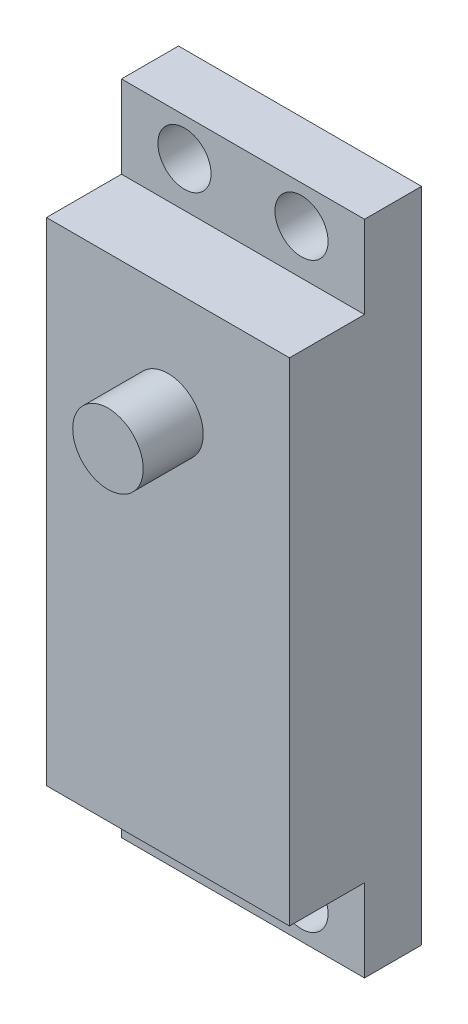
ISO-10303-21;
HEADER;
FILE_DESCRIPTION(('STEP AP214'),'2;1');
FILE_NAME('part.step','',(''),(''),'','','');
FILE_SCHEMA(('AUTOMOTIVE_DESIGN { 1 0 10303 214 1 1 1 1 }'));
ENDSEC;
DATA;
#1=APPLICATION_CONTEXT('core data for automotive mechanical design processes');
#2=APPLICATION_PROTOCOL_DEFINITION('international standard','automotive_design',2000,#1);
#3=PRODUCT_CONTEXT('',#1,'mechanical');
#4=PRODUCT('Part','Part','',(#3));
#5=PRODUCT_RELATED_PRODUCT_CATEGORY('part','',(#4));
#6=PRODUCT_DEFINITION_FORMATION('','',#4);
#7=PRODUCT_DEFINITION_CONTEXT('part definition',#1,'design');
#8=PRODUCT_DEFINITION('design','',#6,#7);
#9=PRODUCT_DEFINITION_SHAPE('','',#8);
#10=(LENGTH_UNIT() NAMED_UNIT(*) SI_UNIT(.MILLI.,.METRE.));
#11=(NAMED_UNIT(*) PLANE_ANGLE_UNIT() SI_UNIT($,.RADIAN.));
#12=(NAMED_UNIT(*) SI_UNIT($,.STERADIAN.) SOLID_ANGLE_UNIT());
#13=UNCERTAINTY_MEASURE_WITH_UNIT(LENGTH_MEASURE(1.E-05),#10,'distance_accuracy_value','');
#14=(GEOMETRIC_REPRESENTATION_CONTEXT(3) GLOBAL_UNCERTAINTY_ASSIGNED_CONTEXT((#13)) GLOBAL_UNIT_ASSIGNED_CONTEXT((#10,
#11,#12)) REPRESENTATION_CONTEXT('',''));
#15=CARTESIAN_POINT('',(0.,0.,0.));
#16=DIRECTION('',(0.,0.,1.));
#17=DIRECTION('',(1.,0.,0.));
#18=AXIS2_PLACEMENT_3D('',#15,#16,#17);
#19=CARTESIAN_POINT('',(-10.287,-27.813,11.176));
#20=DIRECTION('',(1.,0.,0.));
#21=DIRECTION('',(0.,0.,-1.));
#22=AXIS2_PLACEMENT_3D('',#19,#20,#21);
#23=PLANE('',#22);
#24=DIRECTION('',(0.,-1.,0.));
#25=VECTOR('',#24,1.);
#26=CARTESIAN_POINT('',(-10.287,-27.813,11.176));
#27=LINE('',#26,#25);
#28=CARTESIAN_POINT('',(-10.287,20.828,11.176));
#29=VERTEX_POINT('',#28);
#30=CARTESIAN_POINT('',(-10.287,-20.828,11.176));
#31=VERTEX_POINT('',#30);
#32=EDGE_CURVE('E171',#29,#31,#27,.T.);
#33=ORIENTED_EDGE('',*,*,#32,.F.);
#34=DIRECTION('',(0.,0.,1.));
#35=VECTOR('',#34,1.);
#36=CARTESIAN_POINT('',(-10.287,20.828,11.176));
#37=LINE('',#36,#35);
#38=CARTESIAN_POINT('',(-10.287,20.828,4.826));
#39=VERTEX_POINT('',#38);
#40=EDGE_CURVE('E50',#39,#29,#37,.T.);
#41=ORIENTED_EDGE('',*,*,#40,.F.);
#42=DIRECTION('',(0.,-1.,0.));
#43=VECTOR('',#42,1.);
#44=CARTESIAN_POINT('',(-10.287,27.813,4.826));
#45=LINE('',#44,#43);
#46=CARTESIAN_POINT('',(-10.287,27.813,4.826));
#47=VERTEX_POINT('',#46);
#48=EDGE_CURVE('E188',#47,#39,#45,.T.);
#49=ORIENTED_EDGE('',*,*,#48,.F.);
#50=DIRECTION('',(0.,0.,-1.));
#51=VECTOR('',#50,1.);
#52=CARTESIAN_POINT('',(-10.287,27.813,11.176));
#53=LINE('',#52,#51);
#54=CARTESIAN_POINT('',(-10.287,27.813,0.));
#55=VERTEX_POINT('',#54);
#56=EDGE_CURVE('E120',#47,#55,#53,.T.);
#57=ORIENTED_EDGE('',*,*,#56,.T.);
#58=DIRECTION('',(0.,-1.,0.));
#59=VECTOR('',#58,1.);
#60=CARTESIAN_POINT('',(-10.287,-27.813,0.));
#61=LINE('',#60,#59);
#62=CARTESIAN_POINT('',(-10.287,-27.813,0.));
#63=VERTEX_POINT('',#62);
#64=EDGE_CURVE('E170',#55,#63,#61,.T.);
#65=ORIENTED_EDGE('',*,*,#64,.T.);
#66=DIRECTION('',(0.,0.,-1.));
#67=VECTOR('',#66,1.);
#68=CARTESIAN_POINT('',(-10.287,-27.813,11.176));
#69=LINE('',#68,#67);
#70=CARTESIAN_POINT('',(-10.287,-27.813,4.826));
#71=VERTEX_POINT('',#70);
#72=EDGE_CURVE('E42',#71,#63,#69,.T.);
#73=ORIENTED_EDGE('',*,*,#72,.F.);
#74=DIRECTION('',(0.,-1.,0.));
#75=VECTOR('',#74,1.);
#76=CARTESIAN_POINT('',(-10.287,-27.813,4.826));
#77=LINE('',#76,#75);
#78=CARTESIAN_POINT('',(-10.287,-20.828,4.826));
#79=VERTEX_POINT('',#78);
#80=EDGE_CURVE('E151',#79,#71,#77,.T.);
#81=ORIENTED_EDGE('',*,*,#80,.F.);
#82=DIRECTION('',(0.,0.,-1.));
#83=VECTOR('',#82,1.);
#84=CARTESIAN_POINT('',(-10.287,-20.828,11.176));
#85=LINE('',#84,#83);
#86=EDGE_CURVE('E199',#31,#79,#85,.T.);
#87=ORIENTED_EDGE('',*,*,#86,.F.);
#88=EDGE_LOOP('',(#33,#41,#49,#57,#65,#73,#81,#87));
#89=FACE_BOUND('',#88,.T.);
#90=ADVANCED_FACE('F34',(#89),#23,.F.);
#91=CARTESIAN_POINT('',(-10.287,-27.813,11.176));
#92=DIRECTION('',(0.,1.,0.));
#93=DIRECTION('',(0.,0.,1.));
#94=AXIS2_PLACEMENT_3D('',#91,#92,#93);
#95=PLANE('',#94);
#96=DIRECTION('',(0.,0.,-1.));
#97=VECTOR('',#96,1.);
#98=CARTESIAN_POINT('',(10.287,-27.813,11.176));
#99=LINE('',#98,#97);
#100=CARTESIAN_POINT('',(10.287,-27.813,4.826));
#101=VERTEX_POINT('',#100);
#102=CARTESIAN_POINT('',(10.287,-27.813,0.));
#103=VERTEX_POINT('',#102);
#104=EDGE_CURVE('E126',#101,#103,#99,.T.);
#105=ORIENTED_EDGE('',*,*,#104,.F.);
#106=DIRECTION('',(-1.,0.,0.));
#107=VECTOR('',#106,1.);
#108=CARTESIAN_POINT('',(10.287,-27.813,4.826));
#109=LINE('',#108,#107);
#110=EDGE_CURVE('E136',#101,#71,#109,.T.);
#111=ORIENTED_EDGE('',*,*,#110,.T.);
#112=ORIENTED_EDGE('',*,*,#72,.T.);
#113=DIRECTION('',(1.,0.,0.));
#114=VECTOR('',#113,1.);
#115=CARTESIAN_POINT('',(-10.287,-27.813,0.));
#116=LINE('',#115,#114);
#117=EDGE_CURVE('E178',#63,#103,#116,.T.);
#118=ORIENTED_EDGE('',*,*,#117,.T.);
#119=EDGE_LOOP('',(#105,#111,#112,#118));
#120=FACE_BOUND('',#119,.T.);
#121=ADVANCED_FACE('F226',(#120),#95,.F.);
#122=CARTESIAN_POINT('',(10.287,-27.813,11.176));
#123=DIRECTION('',(-1.,0.,0.));
#124=DIRECTION('',(0.,0.,1.));
#125=AXIS2_PLACEMENT_3D('',#122,#123,#124);
#126=PLANE('',#125);
#127=DIRECTION('',(0.,-1.,0.));
#128=VECTOR('',#127,1.);
#129=CARTESIAN_POINT('',(10.287,27.813,4.826));
#130=LINE('',#129,#128);
#131=CARTESIAN_POINT('',(10.287,27.813,4.826));
#132=VERTEX_POINT('',#131);
#133=CARTESIAN_POINT('',(10.287,20.828,4.826));
#134=VERTEX_POINT('',#133);
#135=EDGE_CURVE('E100',#132,#134,#130,.T.);
#136=ORIENTED_EDGE('',*,*,#135,.T.);
#137=DIRECTION('',(0.,0.,1.));
#138=VECTOR('',#137,1.);
#139=CARTESIAN_POINT('',(10.287,20.828,11.176));
#140=LINE('',#139,#138);
#141=CARTESIAN_POINT('',(10.287,20.828,11.176));
#142=VERTEX_POINT('',#141);
#143=EDGE_CURVE('E112',#134,#142,#140,.T.);
#144=ORIENTED_EDGE('',*,*,#143,.T.);
#145=DIRECTION('',(0.,1.,0.));
#146=VECTOR('',#145,1.);
#147=CARTESIAN_POINT('',(10.287,-27.813,11.176));
#148=LINE('',#147,#146);
#149=CARTESIAN_POINT('',(10.287,-20.828,11.176));
#150=VERTEX_POINT('',#149);
#151=EDGE_CURVE('E129',#150,#142,#148,.T.);
#152=ORIENTED_EDGE('',*,*,#151,.F.);
#153=DIRECTION('',(0.,0.,-1.));
#154=VECTOR('',#153,1.);
#155=CARTESIAN_POINT('',(10.287,-20.828,11.176));
#156=LINE('',#155,#154);
#157=CARTESIAN_POINT('',(10.287,-20.828,4.826));
#158=VERTEX_POINT('',#157);
#159=EDGE_CURVE('E58',#150,#158,#156,.T.);
#160=ORIENTED_EDGE('',*,*,#159,.T.);
#161=DIRECTION('',(0.,-1.,0.));
#162=VECTOR('',#161,1.);
#163=CARTESIAN_POINT('',(10.287,-27.813,4.826));
#164=LINE('',#163,#162);
#165=EDGE_CURVE('E154',#158,#101,#164,.T.);
#166=ORIENTED_EDGE('',*,*,#165,.T.);
#167=ORIENTED_EDGE('',*,*,#104,.T.);
#168=DIRECTION('',(0.,1.,0.));
#169=VECTOR('',#168,1.);
#170=CARTESIAN_POINT('',(10.287,-27.813,0.));
#171=LINE('',#170,#169);
#172=CARTESIAN_POINT('',(10.287,27.813,0.));
#173=VERTEX_POINT('',#172);
#174=EDGE_CURVE('E124',#103,#173,#171,.T.);
#175=ORIENTED_EDGE('',*,*,#174,.T.);
#176=DIRECTION('',(0.,0.,-1.));
#177=VECTOR('',#176,1.);
#178=CARTESIAN_POINT('',(10.287,27.813,11.176));
#179=LINE('',#178,#177);
#180=EDGE_CURVE('E118',#132,#173,#179,.T.);
#181=ORIENTED_EDGE('',*,*,#180,.F.);
#182=EDGE_LOOP('',(#136,#144,#152,#160,#166,#167,#175,#181));
#183=FACE_BOUND('',#182,.T.);
#184=ADVANCED_FACE('F122',(#183),#126,.F.);
#185=CARTESIAN_POINT('',(-10.287,27.813,11.176));
#186=DIRECTION('',(0.,-1.,0.));
#187=DIRECTION('',(0.,0.,-1.));
#188=AXIS2_PLACEMENT_3D('',#185,#186,#187);
#189=PLANE('',#188);
#190=ORIENTED_EDGE('',*,*,#56,.F.);
#191=DIRECTION('',(-1.,0.,0.));
#192=VECTOR('',#191,1.);
#193=CARTESIAN_POINT('',(10.287,27.813,4.826));
#194=LINE('',#193,#192);
#195=EDGE_CURVE('E105',#132,#47,#194,.T.);
#196=ORIENTED_EDGE('',*,*,#195,.F.);
#197=ORIENTED_EDGE('',*,*,#180,.T.);
#198=DIRECTION('',(-1.,0.,0.));
#199=VECTOR('',#198,1.);
#200=CARTESIAN_POINT('',(-10.287,27.813,0.));
#201=LINE('',#200,#199);
#202=EDGE_CURVE('E173',#173,#55,#201,.T.);
#203=ORIENTED_EDGE('',*,*,#202,.T.);
#204=EDGE_LOOP('',(#190,#196,#197,#203));
#205=FACE_BOUND('',#204,.T.);
#206=ADVANCED_FACE('F116',(#205),#189,.F.);
#207=CARTESIAN_POINT('',(0.,0.,11.176));
#208=DIRECTION('',(0.,0.,-1.));
#209=DIRECTION('',(-1.,0.,0.));
#210=AXIS2_PLACEMENT_3D('',#207,#208,#209);
#211=PLANE('',#210);
#212=CARTESIAN_POINT('',(0.,11.557,11.176));
#213=DIRECTION('',(0.,0.,-1.));
#214=DIRECTION('',(-1.,0.,0.));
#215=AXIS2_PLACEMENT_3D('',#212,#213,#214);
#216=CIRCLE('',#215,2.9845);
#217=CARTESIAN_POINT('',(-2.98449999999999,11.557,11.176));
#218=VERTEX_POINT('',#217);
#219=EDGE_CURVE('E11',#218,#218,#216,.F.);
#220=ORIENTED_EDGE('',*,*,#219,.F.);
#221=EDGE_LOOP('',(#220));
#222=FACE_BOUND('',#221,.T.);
#223=ORIENTED_EDGE('',*,*,#151,.T.);
#224=DIRECTION('',(-1.,0.,0.));
#225=VECTOR('',#224,1.);
#226=CARTESIAN_POINT('',(10.287,20.828,11.176));
#227=LINE('',#226,#225);
#228=EDGE_CURVE('E193',#142,#29,#227,.T.);
#229=ORIENTED_EDGE('',*,*,#228,.T.);
#230=ORIENTED_EDGE('',*,*,#32,.T.);
#231=DIRECTION('',(-1.,0.,0.));
#232=VECTOR('',#231,1.);
#233=CARTESIAN_POINT('',(10.287,-20.828,11.176));
#234=LINE('',#233,#232);
#235=EDGE_CURVE('E148',#150,#31,#234,.T.);
#236=ORIENTED_EDGE('',*,*,#235,.F.);
#237=EDGE_LOOP('',(#223,#229,#230,#236));
#238=FACE_BOUND('',#237,.T.);
#239=ADVANCED_FACE('F209',(#222,#238),#211,.F.);
#240=CARTESIAN_POINT('',(0.,0.,0.));
#241=DIRECTION('',(0.,0.,-1.));
#242=DIRECTION('',(-1.,0.,0.));
#243=AXIS2_PLACEMENT_3D('',#240,#241,#242);
#244=PLANE('',#243);
#245=CARTESIAN_POINT('',(-4.953,-24.638,0.));
#246=DIRECTION('',(0.,0.,-1.));
#247=DIRECTION('',(-1.,0.,0.));
#248=AXIS2_PLACEMENT_3D('',#245,#246,#247);
#249=CIRCLE('',#248,2.2479);
#250=CARTESIAN_POINT('',(-7.2009,-24.638,0.));
#251=VERTEX_POINT('',#250);
#252=EDGE_CURVE('E140',#251,#251,#249,.T.);
#253=ORIENTED_EDGE('',*,*,#252,.F.);
#254=EDGE_LOOP('',(#253));
#255=FACE_BOUND('',#254,.T.);
#256=CARTESIAN_POINT('',(4.953,-24.638,0.));
#257=DIRECTION('',(0.,0.,-1.));
#258=DIRECTION('',(-1.,0.,0.));
#259=AXIS2_PLACEMENT_3D('',#256,#257,#258);
#260=CIRCLE('',#259,2.2479);
#261=CARTESIAN_POINT('',(2.7051,-24.638,0.));
#262=VERTEX_POINT('',#261);
#263=EDGE_CURVE('E158',#262,#262,#260,.T.);
#264=ORIENTED_EDGE('',*,*,#263,.F.);
#265=EDGE_LOOP('',(#264));
#266=FACE_BOUND('',#265,.T.);
#267=CARTESIAN_POINT('',(4.953,24.638,0.));
#268=DIRECTION('',(0.,0.,-1.));
#269=DIRECTION('',(-1.,0.,0.));
#270=AXIS2_PLACEMENT_3D('',#267,#268,#269);
#271=CIRCLE('',#270,2.2479);
#272=CARTESIAN_POINT('',(2.7051,24.638,0.));
#273=VERTEX_POINT('',#272);
#274=EDGE_CURVE('E161',#273,#273,#271,.T.);
#275=ORIENTED_EDGE('',*,*,#274,.F.);
#276=EDGE_LOOP('',(#275));
#277=FACE_BOUND('',#276,.T.);
#278=CARTESIAN_POINT('',(-4.953,24.638,0.));
#279=DIRECTION('',(0.,0.,-1.));
#280=DIRECTION('',(-1.,0.,0.));
#281=AXIS2_PLACEMENT_3D('',#278,#279,#280);
#282=CIRCLE('',#281,2.2479);
#283=CARTESIAN_POINT('',(-7.2009,24.638,0.));
#284=VERTEX_POINT('',#283);
#285=EDGE_CURVE('E164',#284,#284,#282,.T.);
#286=ORIENTED_EDGE('',*,*,#285,.F.);
#287=EDGE_LOOP('',(#286));
#288=FACE_BOUND('',#287,.T.);
#289=ORIENTED_EDGE('',*,*,#64,.F.);
#290=ORIENTED_EDGE('',*,*,#202,.F.);
#291=ORIENTED_EDGE('',*,*,#174,.F.);
#292=ORIENTED_EDGE('',*,*,#117,.F.);
#293=EDGE_LOOP('',(#289,#290,#291,#292));
#294=FACE_BOUND('',#293,.T.);
#295=ADVANCED_FACE('F184',(#255,#266,#277,#288,#294),#244,.T.);
#296=CARTESIAN_POINT('',(0.,11.557,16.256));
#297=DIRECTION('',(0.,0.,-1.));
#298=DIRECTION('',(-1.,0.,0.));
#299=AXIS2_PLACEMENT_3D('',#296,#297,#298);
#300=CYLINDRICAL_SURFACE('',#299,2.9845);
#301=CARTESIAN_POINT('',(0.,11.557,16.256));
#302=DIRECTION('',(0.,0.,1.));
#303=DIRECTION('',(1.,0.,0.));
#304=AXIS2_PLACEMENT_3D('',#301,#302,#303);
#305=CIRCLE('',#304,2.9845);
#306=CARTESIAN_POINT('',(2.9845,11.557,16.256));
#307=VERTEX_POINT('',#306);
#308=EDGE_CURVE('E167',#307,#307,#305,.T.);
#309=ORIENTED_EDGE('',*,*,#308,.F.);
#310=EDGE_LOOP('',(#309));
#311=FACE_BOUND('',#310,.T.);
#312=ORIENTED_EDGE('',*,*,#219,.T.);
#313=EDGE_LOOP('',(#312));
#314=FACE_BOUND('',#313,.T.);
#315=ADVANCED_FACE('F240',(#311,#314),#300,.T.);
#316=CARTESIAN_POINT('',(0.,11.557,16.256));
#317=DIRECTION('',(0.,0.,1.));
#318=DIRECTION('',(1.,0.,0.));
#319=AXIS2_PLACEMENT_3D('',#316,#317,#318);
#320=PLANE('',#319);
#321=ORIENTED_EDGE('',*,*,#308,.T.);
#322=EDGE_LOOP('',(#321));
#323=FACE_BOUND('',#322,.T.);
#324=ADVANCED_FACE('F247',(#323),#320,.T.);
#325=CARTESIAN_POINT('',(-4.953,24.638,0.));
#326=DIRECTION('',(0.,0.,-1.));
#327=DIRECTION('',(-1.,0.,0.));
#328=AXIS2_PLACEMENT_3D('',#325,#326,#327);
#329=CYLINDRICAL_SURFACE('',#328,2.2479);
#330=CARTESIAN_POINT('',(-4.953,24.638,4.826));
#331=DIRECTION('',(0.,0.,-1.));
#332=DIRECTION('',(0.,1.,0.));
#333=AXIS2_PLACEMENT_3D('',#330,#331,#332);
#334=CIRCLE('',#333,2.2479);
#335=CARTESIAN_POINT('',(-4.953,26.8859,4.826));
#336=VERTEX_POINT('',#335);
#337=EDGE_CURVE('E196',#336,#336,#334,.F.);
#338=ORIENTED_EDGE('',*,*,#337,.T.);
#339=EDGE_LOOP('',(#338));
#340=FACE_BOUND('',#339,.T.);
#341=ORIENTED_EDGE('',*,*,#285,.T.);
#342=EDGE_LOOP('',(#341));
#343=FACE_BOUND('',#342,.T.);
#344=ADVANCED_FACE('F251',(#340,#343),#329,.F.);
#345=CARTESIAN_POINT('',(4.953,24.638,0.));
#346=DIRECTION('',(0.,0.,-1.));
#347=DIRECTION('',(-1.,0.,0.));
#348=AXIS2_PLACEMENT_3D('',#345,#346,#347);
#349=CYLINDRICAL_SURFACE('',#348,2.2479);
#350=CARTESIAN_POINT('',(4.953,24.638,4.826));
#351=DIRECTION('',(0.,0.,-1.));
#352=DIRECTION('',(0.,1.,0.));
#353=AXIS2_PLACEMENT_3D('',#350,#351,#352);
#354=CIRCLE('',#353,2.2479);
#355=CARTESIAN_POINT('',(4.953,26.8859,4.826));
#356=VERTEX_POINT('',#355);
#357=EDGE_CURVE('E37',#356,#356,#354,.F.);
#358=ORIENTED_EDGE('',*,*,#357,.T.);
#359=EDGE_LOOP('',(#358));
#360=FACE_BOUND('',#359,.T.);
#361=ORIENTED_EDGE('',*,*,#274,.T.);
#362=EDGE_LOOP('',(#361));
#363=FACE_BOUND('',#362,.T.);
#364=ADVANCED_FACE('F255',(#360,#363),#349,.F.);
#365=CARTESIAN_POINT('',(4.953,-24.638,0.));
#366=DIRECTION('',(0.,0.,-1.));
#367=DIRECTION('',(-1.,0.,0.));
#368=AXIS2_PLACEMENT_3D('',#365,#366,#367);
#369=CYLINDRICAL_SURFACE('',#368,2.2479);
#370=CARTESIAN_POINT('',(4.953,-24.638,4.826));
#371=DIRECTION('',(0.,0.,-1.));
#372=DIRECTION('',(-1.,0.,0.));
#373=AXIS2_PLACEMENT_3D('',#370,#371,#372);
#374=CIRCLE('',#373,2.2479);
#375=CARTESIAN_POINT('',(2.7051,-24.638,4.826));
#376=VERTEX_POINT('',#375);
#377=EDGE_CURVE('E135',#376,#376,#374,.F.);
#378=ORIENTED_EDGE('',*,*,#377,.T.);
#379=EDGE_LOOP('',(#378));
#380=FACE_BOUND('',#379,.T.);
#381=ORIENTED_EDGE('',*,*,#263,.T.);
#382=EDGE_LOOP('',(#381));
#383=FACE_BOUND('',#382,.T.);
#384=ADVANCED_FACE('F259',(#380,#383),#369,.F.);
#385=CARTESIAN_POINT('',(-4.953,-24.638,0.));
#386=DIRECTION('',(0.,0.,-1.));
#387=DIRECTION('',(-1.,0.,0.));
#388=AXIS2_PLACEMENT_3D('',#385,#386,#387);
#389=CYLINDRICAL_SURFACE('',#388,2.2479);
#390=CARTESIAN_POINT('',(-4.953,-24.638,4.826));
#391=DIRECTION('',(0.,0.,-1.));
#392=DIRECTION('',(-1.,0.,0.));
#393=AXIS2_PLACEMENT_3D('',#390,#391,#392);
#394=CIRCLE('',#393,2.2479);
#395=CARTESIAN_POINT('',(-7.2009,-24.638,4.826));
#396=VERTEX_POINT('',#395);
#397=EDGE_CURVE('E133',#396,#396,#394,.F.);
#398=ORIENTED_EDGE('',*,*,#397,.T.);
#399=EDGE_LOOP('',(#398));
#400=FACE_BOUND('',#399,.T.);
#401=ORIENTED_EDGE('',*,*,#252,.T.);
#402=EDGE_LOOP('',(#401));
#403=FACE_BOUND('',#402,.T.);
#404=ADVANCED_FACE('F221',(#400,#403),#389,.F.);
#405=CARTESIAN_POINT('',(10.287,-27.813,4.826));
#406=DIRECTION('',(0.,0.,-1.));
#407=DIRECTION('',(-1.,0.,0.));
#408=AXIS2_PLACEMENT_3D('',#405,#406,#407);
#409=PLANE('',#408);
#410=ORIENTED_EDGE('',*,*,#397,.F.);
#411=EDGE_LOOP('',(#410));
#412=FACE_BOUND('',#411,.T.);
#413=ORIENTED_EDGE('',*,*,#80,.T.);
#414=ORIENTED_EDGE('',*,*,#110,.F.);
#415=ORIENTED_EDGE('',*,*,#165,.F.);
#416=DIRECTION('',(-1.,0.,0.));
#417=VECTOR('',#416,1.);
#418=CARTESIAN_POINT('',(10.287,-20.828,4.826));
#419=LINE('',#418,#417);
#420=EDGE_CURVE('E143',#158,#79,#419,.T.);
#421=ORIENTED_EDGE('',*,*,#420,.T.);
#422=EDGE_LOOP('',(#413,#414,#415,#421));
#423=FACE_BOUND('',#422,.T.);
#424=ORIENTED_EDGE('',*,*,#377,.F.);
#425=EDGE_LOOP('',(#424));
#426=FACE_BOUND('',#425,.T.);
#427=ADVANCED_FACE('F205',(#412,#423,#426),#409,.F.);
#428=CARTESIAN_POINT('',(10.287,-20.828,11.176));
#429=DIRECTION('',(0.,1.,0.));
#430=DIRECTION('',(0.,0.,1.));
#431=AXIS2_PLACEMENT_3D('',#428,#429,#430);
#432=PLANE('',#431);
#433=ORIENTED_EDGE('',*,*,#86,.T.);
#434=ORIENTED_EDGE('',*,*,#420,.F.);
#435=ORIENTED_EDGE('',*,*,#159,.F.);
#436=ORIENTED_EDGE('',*,*,#235,.T.);
#437=EDGE_LOOP('',(#433,#434,#435,#436));
#438=FACE_BOUND('',#437,.T.);
#439=ADVANCED_FACE('F211',(#438),#432,.F.);
#440=CARTESIAN_POINT('',(10.287,27.813,4.826));
#441=DIRECTION('',(0.,0.,-1.));
#442=DIRECTION('',(0.,1.,0.));
#443=AXIS2_PLACEMENT_3D('',#440,#441,#442);
#444=PLANE('',#443);
#445=ORIENTED_EDGE('',*,*,#357,.F.);
#446=EDGE_LOOP('',(#445));
#447=FACE_BOUND('',#446,.T.);
#448=ORIENTED_EDGE('',*,*,#48,.T.);
#449=DIRECTION('',(-1.,0.,0.));
#450=VECTOR('',#449,1.);
#451=CARTESIAN_POINT('',(10.287,20.828,4.826));
#452=LINE('',#451,#450);
#453=EDGE_CURVE('E107',#134,#39,#452,.T.);
#454=ORIENTED_EDGE('',*,*,#453,.F.);
#455=ORIENTED_EDGE('',*,*,#135,.F.);
#456=ORIENTED_EDGE('',*,*,#195,.T.);
#457=EDGE_LOOP('',(#448,#454,#455,#456));
#458=FACE_BOUND('',#457,.T.);
#459=ORIENTED_EDGE('',*,*,#337,.F.);
#460=EDGE_LOOP('',(#459));
#461=FACE_BOUND('',#460,.T.);
#462=ADVANCED_FACE('F103',(#447,#458,#461),#444,.F.);
#463=CARTESIAN_POINT('',(10.287,20.828,11.176));
#464=DIRECTION('',(0.,-1.,0.));
#465=DIRECTION('',(0.,0.,-1.));
#466=AXIS2_PLACEMENT_3D('',#463,#464,#465);
#467=PLANE('',#466);
#468=ORIENTED_EDGE('',*,*,#40,.T.);
#469=ORIENTED_EDGE('',*,*,#228,.F.);
#470=ORIENTED_EDGE('',*,*,#143,.F.);
#471=ORIENTED_EDGE('',*,*,#453,.T.);
#472=EDGE_LOOP('',(#468,#469,#470,#471));
#473=FACE_BOUND('',#472,.T.);
#474=ADVANCED_FACE('F218',(#473),#467,.F.);
#475=CLOSED_SHELL('',(#90,#121,#184,#206,#239,#295,#315,#324,#344,#364,#384,#404,#427,#439,#462,#474));
#476=MANIFOLD_SOLID_BREP('B2',#475);
#477=ADVANCED_BREP_SHAPE_REPRESENTATION('',(#18,#476),#14);
#478=SHAPE_DEFINITION_REPRESENTATION(#9,#477);
ENDSEC;
END-ISO-10303-21;
